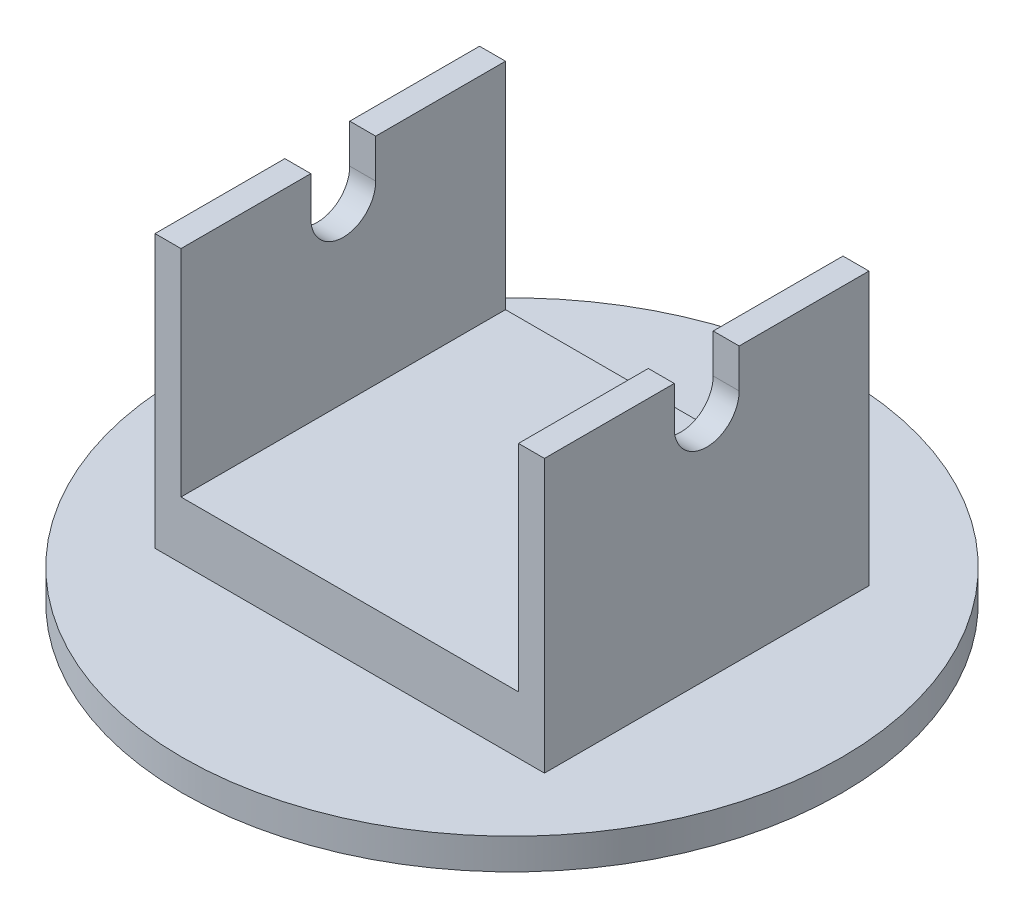
ISO-10303-21;
HEADER;
FILE_DESCRIPTION(('STEP AP214'),'2;1');
FILE_NAME('part.step','',(''),(''),'','','');
FILE_SCHEMA(('AUTOMOTIVE_DESIGN { 1 0 10303 214 1 1 1 1 }'));
ENDSEC;
DATA;
#1=APPLICATION_CONTEXT('core data for automotive mechanical design processes');
#2=APPLICATION_PROTOCOL_DEFINITION('international standard','automotive_design',2000,#1);
#3=PRODUCT_CONTEXT('',#1,'mechanical');
#4=PRODUCT('Part','Part','',(#3));
#5=PRODUCT_RELATED_PRODUCT_CATEGORY('part','',(#4));
#6=PRODUCT_DEFINITION_FORMATION('','',#4);
#7=PRODUCT_DEFINITION_CONTEXT('part definition',#1,'design');
#8=PRODUCT_DEFINITION('design','',#6,#7);
#9=PRODUCT_DEFINITION_SHAPE('','',#8);
#10=(LENGTH_UNIT() NAMED_UNIT(*) SI_UNIT(.MILLI.,.METRE.));
#11=(NAMED_UNIT(*) PLANE_ANGLE_UNIT() SI_UNIT($,.RADIAN.));
#12=(NAMED_UNIT(*) SI_UNIT($,.STERADIAN.) SOLID_ANGLE_UNIT());
#13=UNCERTAINTY_MEASURE_WITH_UNIT(LENGTH_MEASURE(1.E-05),#10,'distance_accuracy_value','');
#14=(GEOMETRIC_REPRESENTATION_CONTEXT(3) GLOBAL_UNCERTAINTY_ASSIGNED_CONTEXT((#13)) GLOBAL_UNIT_ASSIGNED_CONTEXT((#10,
#11,#12)) REPRESENTATION_CONTEXT('',''));
#15=CARTESIAN_POINT('',(0.,0.,0.));
#16=DIRECTION('',(0.,0.,1.));
#17=DIRECTION('',(1.,0.,0.));
#18=AXIS2_PLACEMENT_3D('',#15,#16,#17);
#19=CARTESIAN_POINT('',(30.,46.7625,-16.));
#20=DIRECTION('',(0.,-1.,0.));
#21=DIRECTION('',(0.,0.,-1.));
#22=AXIS2_PLACEMENT_3D('',#19,#20,#21);
#23=PLANE('',#22);
#24=DIRECTION('',(1.,0.,0.));
#25=VECTOR('',#24,1.);
#26=CARTESIAN_POINT('',(-50.8,46.7625,5.));
#27=LINE('',#26,#25);
#28=CARTESIAN_POINT('',(26.,46.7625,5.));
#29=VERTEX_POINT('',#28);
#30=CARTESIAN_POINT('',(30.,46.7625,5.));
#31=VERTEX_POINT('',#30);
#32=EDGE_CURVE('E278',#29,#31,#27,.T.);
#33=ORIENTED_EDGE('',*,*,#32,.F.);
#34=DIRECTION('',(0.,0.,1.));
#35=VECTOR('',#34,1.);
#36=CARTESIAN_POINT('',(26.,46.7625,-50.8));
#37=LINE('',#36,#35);
#38=CARTESIAN_POINT('',(26.,46.7625,25.));
#39=VERTEX_POINT('',#38);
#40=EDGE_CURVE('E291',#29,#39,#37,.T.);
#41=ORIENTED_EDGE('',*,*,#40,.T.);
#42=DIRECTION('',(-1.,0.,0.));
#43=VECTOR('',#42,1.);
#44=CARTESIAN_POINT('',(-30.,46.7625,25.));
#45=LINE('',#44,#43);
#46=CARTESIAN_POINT('',(30.,46.7625,25.));
#47=VERTEX_POINT('',#46);
#48=EDGE_CURVE('E169',#47,#39,#45,.T.);
#49=ORIENTED_EDGE('',*,*,#48,.F.);
#50=DIRECTION('',(0.,0.,1.));
#51=VECTOR('',#50,1.);
#52=CARTESIAN_POINT('',(30.,46.7625,-16.));
#53=LINE('',#52,#51);
#54=EDGE_CURVE('E178',#31,#47,#53,.T.);
#55=ORIENTED_EDGE('',*,*,#54,.F.);
#56=EDGE_LOOP('',(#33,#41,#49,#55));
#57=FACE_BOUND('',#56,.T.);
#58=ADVANCED_FACE('F33',(#57),#23,.F.);
#59=DIRECTION('',(1.,0.,0.));
#60=VECTOR('',#59,1.);
#61=CARTESIAN_POINT('',(-30.,46.7625,-25.));
#62=LINE('',#61,#60);
#63=CARTESIAN_POINT('',(26.,46.7625,-25.));
#64=VERTEX_POINT('',#63);
#65=CARTESIAN_POINT('',(30.,46.7625,-25.));
#66=VERTEX_POINT('',#65);
#67=EDGE_CURVE('E167',#64,#66,#62,.T.);
#68=ORIENTED_EDGE('',*,*,#67,.F.);
#69=CARTESIAN_POINT('',(26.,46.7625,-5.));
#70=VERTEX_POINT('',#69);
#71=EDGE_CURVE('E268',#64,#70,#37,.T.);
#72=ORIENTED_EDGE('',*,*,#71,.T.);
#73=DIRECTION('',(1.,0.,0.));
#74=VECTOR('',#73,1.);
#75=CARTESIAN_POINT('',(-50.8,46.7625,-5.));
#76=LINE('',#75,#74);
#77=CARTESIAN_POINT('',(30.,46.7625,-5.));
#78=VERTEX_POINT('',#77);
#79=EDGE_CURVE('E216',#70,#78,#76,.T.);
#80=ORIENTED_EDGE('',*,*,#79,.T.);
#81=EDGE_CURVE('E180',#66,#78,#53,.T.);
#82=ORIENTED_EDGE('',*,*,#81,.F.);
#83=EDGE_LOOP('',(#68,#72,#80,#82));
#84=FACE_BOUND('',#83,.T.);
#85=ADVANCED_FACE('F267',(#84),#23,.F.);
#86=CARTESIAN_POINT('',(-50.8,40.7625,0.));
#87=DIRECTION('',(1.,0.,0.));
#88=DIRECTION('',(0.,0.,-1.));
#89=AXIS2_PLACEMENT_3D('',#86,#87,#88);
#90=CYLINDRICAL_SURFACE('',#89,5.);
#91=DIRECTION('',(1.,0.,0.));
#92=VECTOR('',#91,1.);
#93=CARTESIAN_POINT('',(-50.8,40.7625,-5.));
#94=LINE('',#93,#92);
#95=CARTESIAN_POINT('',(26.,40.7625,-5.));
#96=VERTEX_POINT('',#95);
#97=CARTESIAN_POINT('',(30.,40.7625,-5.));
#98=VERTEX_POINT('',#97);
#99=EDGE_CURVE('E214',#96,#98,#94,.T.);
#100=ORIENTED_EDGE('',*,*,#99,.F.);
#101=CARTESIAN_POINT('',(26.,40.7625,0.));
#102=DIRECTION('',(1.,0.,0.));
#103=DIRECTION('',(0.,0.,-1.));
#104=AXIS2_PLACEMENT_3D('',#101,#102,#103);
#105=CIRCLE('',#104,5.);
#106=CARTESIAN_POINT('',(26.,40.7625,5.));
#107=VERTEX_POINT('',#106);
#108=EDGE_CURVE('E152',#96,#107,#105,.F.);
#109=ORIENTED_EDGE('',*,*,#108,.T.);
#110=DIRECTION('',(1.,0.,0.));
#111=VECTOR('',#110,1.);
#112=CARTESIAN_POINT('',(-50.8,40.7625,5.));
#113=LINE('',#112,#111);
#114=CARTESIAN_POINT('',(30.,40.7625,5.));
#115=VERTEX_POINT('',#114);
#116=EDGE_CURVE('E275',#107,#115,#113,.T.);
#117=ORIENTED_EDGE('',*,*,#116,.T.);
#118=CARTESIAN_POINT('',(30.,40.7625,0.));
#119=DIRECTION('',(1.,0.,0.));
#120=DIRECTION('',(0.,0.,-1.));
#121=AXIS2_PLACEMENT_3D('',#118,#119,#120);
#122=CIRCLE('',#121,5.);
#123=EDGE_CURVE('E224',#115,#98,#122,.T.);
#124=ORIENTED_EDGE('',*,*,#123,.T.);
#125=EDGE_LOOP('',(#100,#109,#117,#124));
#126=FACE_BOUND('',#125,.T.);
#127=ADVANCED_FACE('F221',(#126),#90,.F.);
#128=CARTESIAN_POINT('',(-50.8,40.7625,5.));
#129=DIRECTION('',(0.,0.,1.));
#130=DIRECTION('',(0.,-1.,0.));
#131=AXIS2_PLACEMENT_3D('',#128,#129,#130);
#132=PLANE('',#131);
#133=ORIENTED_EDGE('',*,*,#116,.F.);
#134=DIRECTION('',(0.,1.,0.));
#135=VECTOR('',#134,1.);
#136=CARTESIAN_POINT('',(26.,40.7625,5.));
#137=LINE('',#136,#135);
#138=EDGE_CURVE('E286',#107,#29,#137,.T.);
#139=ORIENTED_EDGE('',*,*,#138,.T.);
#140=ORIENTED_EDGE('',*,*,#32,.T.);
#141=DIRECTION('',(0.,-1.,0.));
#142=VECTOR('',#141,1.);
#143=CARTESIAN_POINT('',(30.,40.7625,5.));
#144=LINE('',#143,#142);
#145=EDGE_CURVE('E227',#31,#115,#144,.T.);
#146=ORIENTED_EDGE('',*,*,#145,.T.);
#147=EDGE_LOOP('',(#133,#139,#140,#146));
#148=FACE_BOUND('',#147,.T.);
#149=ADVANCED_FACE('F285',(#148),#132,.F.);
#150=CARTESIAN_POINT('',(-50.8,40.7625,-5.));
#151=DIRECTION('',(0.,0.,-1.));
#152=DIRECTION('',(0.,1.,0.));
#153=AXIS2_PLACEMENT_3D('',#150,#151,#152);
#154=PLANE('',#153);
#155=ORIENTED_EDGE('',*,*,#79,.F.);
#156=DIRECTION('',(0.,-1.,0.));
#157=VECTOR('',#156,1.);
#158=CARTESIAN_POINT('',(26.,40.7625,-5.));
#159=LINE('',#158,#157);
#160=EDGE_CURVE('E41',#70,#96,#159,.T.);
#161=ORIENTED_EDGE('',*,*,#160,.T.);
#162=ORIENTED_EDGE('',*,*,#99,.T.);
#163=DIRECTION('',(0.,1.,0.));
#164=VECTOR('',#163,1.);
#165=CARTESIAN_POINT('',(30.,40.7625,-5.));
#166=LINE('',#165,#164);
#167=EDGE_CURVE('E231',#98,#78,#166,.T.);
#168=ORIENTED_EDGE('',*,*,#167,.T.);
#169=EDGE_LOOP('',(#155,#161,#162,#168));
#170=FACE_BOUND('',#169,.T.);
#171=ADVANCED_FACE('F212',(#170),#154,.F.);
#172=CARTESIAN_POINT('',(-26.,46.7625,25.));
#173=VERTEX_POINT('',#172);
#174=CARTESIAN_POINT('',(-30.,46.7625,25.));
#175=VERTEX_POINT('',#174);
#176=EDGE_CURVE('E166',#173,#175,#45,.T.);
#177=ORIENTED_EDGE('',*,*,#176,.F.);
#178=DIRECTION('',(0.,0.,1.));
#179=VECTOR('',#178,1.);
#180=CARTESIAN_POINT('',(-26.,46.7625,-50.8));
#181=LINE('',#180,#179);
#182=CARTESIAN_POINT('',(-26.,46.7625,5.));
#183=VERTEX_POINT('',#182);
#184=EDGE_CURVE('E161',#183,#173,#181,.T.);
#185=ORIENTED_EDGE('',*,*,#184,.F.);
#186=CARTESIAN_POINT('',(-30.,46.7625,5.));
#187=VERTEX_POINT('',#186);
#188=EDGE_CURVE('E276',#187,#183,#27,.T.);
#189=ORIENTED_EDGE('',*,*,#188,.F.);
#190=DIRECTION('',(0.,0.,1.));
#191=VECTOR('',#190,1.);
#192=CARTESIAN_POINT('',(-30.,46.7625,-16.));
#193=LINE('',#192,#191);
#194=EDGE_CURVE('E187',#187,#175,#193,.T.);
#195=ORIENTED_EDGE('',*,*,#194,.T.);
#196=EDGE_LOOP('',(#177,#185,#189,#195));
#197=FACE_BOUND('',#196,.T.);
#198=ADVANCED_FACE('F314',(#197),#23,.F.);
#199=CARTESIAN_POINT('',(0.,4.7625,0.));
#200=DIRECTION('',(0.,-1.,0.));
#201=DIRECTION('',(0.,0.,-1.));
#202=AXIS2_PLACEMENT_3D('',#199,#200,#201);
#203=CYLINDRICAL_SURFACE('',#202,50.8);
#204=CARTESIAN_POINT('',(0.,4.7625,0.));
#205=DIRECTION('',(0.,1.,0.));
#206=DIRECTION('',(0.,0.,1.));
#207=AXIS2_PLACEMENT_3D('',#204,#205,#206);
#208=CIRCLE('',#207,50.8);
#209=CARTESIAN_POINT('',(0.,4.7625,50.8));
#210=VERTEX_POINT('',#209);
#211=EDGE_CURVE('E194',#210,#210,#208,.T.);
#212=ORIENTED_EDGE('',*,*,#211,.F.);
#213=EDGE_LOOP('',(#212));
#214=FACE_BOUND('',#213,.T.);
#215=CARTESIAN_POINT('',(0.,0.,0.));
#216=DIRECTION('',(0.,1.,0.));
#217=DIRECTION('',(0.,0.,1.));
#218=AXIS2_PLACEMENT_3D('',#215,#216,#217);
#219=CIRCLE('',#218,50.8);
#220=CARTESIAN_POINT('',(0.,0.,50.8));
#221=VERTEX_POINT('',#220);
#222=EDGE_CURVE('E193',#221,#221,#219,.T.);
#223=ORIENTED_EDGE('',*,*,#222,.T.);
#224=EDGE_LOOP('',(#223));
#225=FACE_BOUND('',#224,.T.);
#226=ADVANCED_FACE('F35',(#214,#225),#203,.T.);
#227=CARTESIAN_POINT('',(0.,4.7625,0.));
#228=DIRECTION('',(0.,1.,0.));
#229=DIRECTION('',(0.,0.,1.));
#230=AXIS2_PLACEMENT_3D('',#227,#228,#229);
#231=PLANE('',#230);
#232=DIRECTION('',(0.,0.,-1.));
#233=VECTOR('',#232,1.);
#234=CARTESIAN_POINT('',(30.,4.7625,25.));
#235=LINE('',#234,#233);
#236=CARTESIAN_POINT('',(30.,4.7625,25.));
#237=VERTEX_POINT('',#236);
#238=CARTESIAN_POINT('',(30.,4.76250000000003,-25.));
#239=VERTEX_POINT('',#238);
#240=EDGE_CURVE('E175',#237,#239,#235,.T.);
#241=ORIENTED_EDGE('',*,*,#240,.F.);
#242=DIRECTION('',(-1.,0.,0.));
#243=VECTOR('',#242,1.);
#244=CARTESIAN_POINT('',(30.,4.7625,25.));
#245=LINE('',#244,#243);
#246=CARTESIAN_POINT('',(-30.,4.7625,25.));
#247=VERTEX_POINT('',#246);
#248=EDGE_CURVE('E190',#237,#247,#245,.T.);
#249=ORIENTED_EDGE('',*,*,#248,.T.);
#250=DIRECTION('',(0.,0.,-1.));
#251=VECTOR('',#250,1.);
#252=CARTESIAN_POINT('',(-30.,4.7625,25.));
#253=LINE('',#252,#251);
#254=CARTESIAN_POINT('',(-30.,4.76250000000003,-25.));
#255=VERTEX_POINT('',#254);
#256=EDGE_CURVE('E184',#247,#255,#253,.T.);
#257=ORIENTED_EDGE('',*,*,#256,.T.);
#258=DIRECTION('',(-1.,0.,0.));
#259=VECTOR('',#258,1.);
#260=CARTESIAN_POINT('',(30.,4.7625,-25.));
#261=LINE('',#260,#259);
#262=EDGE_CURVE('E183',#239,#255,#261,.T.);
#263=ORIENTED_EDGE('',*,*,#262,.F.);
#264=EDGE_LOOP('',(#241,#249,#257,#263));
#265=FACE_BOUND('',#264,.T.);
#266=ORIENTED_EDGE('',*,*,#211,.T.);
#267=EDGE_LOOP('',(#266));
#268=FACE_BOUND('',#267,.T.);
#269=ADVANCED_FACE('F257',(#265,#268),#231,.T.);
#270=CARTESIAN_POINT('',(0.,0.,0.));
#271=DIRECTION('',(0.,1.,0.));
#272=DIRECTION('',(0.,0.,1.));
#273=AXIS2_PLACEMENT_3D('',#270,#271,#272);
#274=PLANE('',#273);
#275=ORIENTED_EDGE('',*,*,#222,.F.);
#276=EDGE_LOOP('',(#275));
#277=FACE_BOUND('',#276,.T.);
#278=ADVANCED_FACE('F340',(#277),#274,.F.);
#279=CARTESIAN_POINT('',(-30.,46.7625,-5.));
#280=VERTEX_POINT('',#279);
#281=CARTESIAN_POINT('',(-26.,46.7625,-5.));
#282=VERTEX_POINT('',#281);
#283=EDGE_CURVE('E55',#280,#282,#76,.T.);
#284=ORIENTED_EDGE('',*,*,#283,.T.);
#285=CARTESIAN_POINT('',(-26.,46.7625,-25.));
#286=VERTEX_POINT('',#285);
#287=EDGE_CURVE('E48',#286,#282,#181,.T.);
#288=ORIENTED_EDGE('',*,*,#287,.F.);
#289=CARTESIAN_POINT('',(-30.,46.7625,-25.));
#290=VERTEX_POINT('',#289);
#291=EDGE_CURVE('E159',#290,#286,#62,.T.);
#292=ORIENTED_EDGE('',*,*,#291,.F.);
#293=EDGE_CURVE('E179',#290,#280,#193,.T.);
#294=ORIENTED_EDGE('',*,*,#293,.T.);
#295=EDGE_LOOP('',(#284,#288,#292,#294));
#296=FACE_BOUND('',#295,.T.);
#297=ADVANCED_FACE('F157',(#296),#23,.F.);
#298=CARTESIAN_POINT('',(30.,4.7625,25.));
#299=DIRECTION('',(1.,0.,0.));
#300=DIRECTION('',(0.,0.,-1.));
#301=AXIS2_PLACEMENT_3D('',#298,#299,#300);
#302=PLANE('',#301);
#303=ORIENTED_EDGE('',*,*,#145,.F.);
#304=ORIENTED_EDGE('',*,*,#54,.T.);
#305=DIRECTION('',(0.,-1.,0.));
#306=VECTOR('',#305,1.);
#307=CARTESIAN_POINT('',(30.,124.864996759067,25.));
#308=LINE('',#307,#306);
#309=EDGE_CURVE('E240',#47,#237,#308,.T.);
#310=ORIENTED_EDGE('',*,*,#309,.T.);
#311=ORIENTED_EDGE('',*,*,#240,.T.);
#312=DIRECTION('',(0.,-1.,0.));
#313=VECTOR('',#312,1.);
#314=CARTESIAN_POINT('',(30.,124.864996759067,-25.));
#315=LINE('',#314,#313);
#316=EDGE_CURVE('E238',#66,#239,#315,.T.);
#317=ORIENTED_EDGE('',*,*,#316,.F.);
#318=ORIENTED_EDGE('',*,*,#81,.T.);
#319=ORIENTED_EDGE('',*,*,#167,.F.);
#320=ORIENTED_EDGE('',*,*,#123,.F.);
#321=EDGE_LOOP('',(#303,#304,#310,#311,#317,#318,#319,#320));
#322=FACE_BOUND('',#321,.T.);
#323=ADVANCED_FACE('F261',(#322),#302,.T.);
#324=CARTESIAN_POINT('',(-30.,4.7625,25.));
#325=DIRECTION('',(1.,0.,0.));
#326=DIRECTION('',(0.,0.,-1.));
#327=AXIS2_PLACEMENT_3D('',#324,#325,#326);
#328=PLANE('',#327);
#329=ORIENTED_EDGE('',*,*,#194,.F.);
#330=DIRECTION('',(0.,-1.,0.));
#331=VECTOR('',#330,1.);
#332=CARTESIAN_POINT('',(-30.,4.76250000000001,5.));
#333=LINE('',#332,#331);
#334=CARTESIAN_POINT('',(-30.,40.7625,5.));
#335=VERTEX_POINT('',#334);
#336=EDGE_CURVE('E204',#187,#335,#333,.T.);
#337=ORIENTED_EDGE('',*,*,#336,.T.);
#338=CARTESIAN_POINT('',(-30.,40.7625,0.));
#339=DIRECTION('',(1.,0.,0.));
#340=DIRECTION('',(0.,0.,-1.));
#341=AXIS2_PLACEMENT_3D('',#338,#339,#340);
#342=CIRCLE('',#341,5.);
#343=CARTESIAN_POINT('',(-30.,40.7625,-5.));
#344=VERTEX_POINT('',#343);
#345=EDGE_CURVE('E201',#335,#344,#342,.T.);
#346=ORIENTED_EDGE('',*,*,#345,.T.);
#347=DIRECTION('',(0.,1.,0.));
#348=VECTOR('',#347,1.);
#349=CARTESIAN_POINT('',(-30.,4.7625,-5.));
#350=LINE('',#349,#348);
#351=EDGE_CURVE('E197',#344,#280,#350,.T.);
#352=ORIENTED_EDGE('',*,*,#351,.T.);
#353=ORIENTED_EDGE('',*,*,#293,.F.);
#354=DIRECTION('',(0.,-1.,0.));
#355=VECTOR('',#354,1.);
#356=CARTESIAN_POINT('',(-30.,124.864996759067,-25.));
#357=LINE('',#356,#355);
#358=EDGE_CURVE('E165',#290,#255,#357,.T.);
#359=ORIENTED_EDGE('',*,*,#358,.T.);
#360=ORIENTED_EDGE('',*,*,#256,.F.);
#361=DIRECTION('',(0.,-1.,0.));
#362=VECTOR('',#361,1.);
#363=CARTESIAN_POINT('',(-30.,124.864996759067,25.));
#364=LINE('',#363,#362);
#365=EDGE_CURVE('E171',#175,#247,#364,.T.);
#366=ORIENTED_EDGE('',*,*,#365,.F.);
#367=EDGE_LOOP('',(#329,#337,#346,#352,#353,#359,#360,#366));
#368=FACE_BOUND('',#367,.T.);
#369=ADVANCED_FACE('F254',(#368),#328,.F.);
#370=CARTESIAN_POINT('',(-30.,124.864996759067,-25.));
#371=DIRECTION('',(0.,0.,1.));
#372=DIRECTION('',(1.,0.,0.));
#373=AXIS2_PLACEMENT_3D('',#370,#371,#372);
#374=PLANE('',#373);
#375=DIRECTION('',(1.,0.,0.));
#376=VECTOR('',#375,1.);
#377=CARTESIAN_POINT('',(-30.,13.6088,-25.));
#378=LINE('',#377,#376);
#379=CARTESIAN_POINT('',(-26.,13.6088,-25.));
#380=VERTEX_POINT('',#379);
#381=CARTESIAN_POINT('',(26.,13.6088,-25.));
#382=VERTEX_POINT('',#381);
#383=EDGE_CURVE('E270',#380,#382,#378,.T.);
#384=ORIENTED_EDGE('',*,*,#383,.T.);
#385=DIRECTION('',(0.,1.,0.));
#386=VECTOR('',#385,1.);
#387=CARTESIAN_POINT('',(26.,124.864996759067,-25.));
#388=LINE('',#387,#386);
#389=EDGE_CURVE('E265',#382,#64,#388,.T.);
#390=ORIENTED_EDGE('',*,*,#389,.T.);
#391=ORIENTED_EDGE('',*,*,#67,.T.);
#392=ORIENTED_EDGE('',*,*,#316,.T.);
#393=ORIENTED_EDGE('',*,*,#262,.T.);
#394=ORIENTED_EDGE('',*,*,#358,.F.);
#395=ORIENTED_EDGE('',*,*,#291,.T.);
#396=DIRECTION('',(0.,-1.,0.));
#397=VECTOR('',#396,1.);
#398=CARTESIAN_POINT('',(-26.,124.864996759067,-25.));
#399=LINE('',#398,#397);
#400=EDGE_CURVE('E145',#286,#380,#399,.T.);
#401=ORIENTED_EDGE('',*,*,#400,.T.);
#402=EDGE_LOOP('',(#384,#390,#391,#392,#393,#394,#395,#401));
#403=FACE_BOUND('',#402,.T.);
#404=ADVANCED_FACE('F163',(#403),#374,.F.);
#405=CARTESIAN_POINT('',(-30.,124.864996759067,25.));
#406=DIRECTION('',(0.,0.,-1.));
#407=DIRECTION('',(-1.,0.,0.));
#408=AXIS2_PLACEMENT_3D('',#405,#406,#407);
#409=PLANE('',#408);
#410=ORIENTED_EDGE('',*,*,#48,.T.);
#411=DIRECTION('',(0.,-1.,0.));
#412=VECTOR('',#411,1.);
#413=CARTESIAN_POINT('',(26.,124.864996759067,25.));
#414=LINE('',#413,#412);
#415=CARTESIAN_POINT('',(26.,13.6088,25.));
#416=VERTEX_POINT('',#415);
#417=EDGE_CURVE('E293',#39,#416,#414,.T.);
#418=ORIENTED_EDGE('',*,*,#417,.T.);
#419=DIRECTION('',(-1.,0.,0.));
#420=VECTOR('',#419,1.);
#421=CARTESIAN_POINT('',(-30.,13.6088,25.));
#422=LINE('',#421,#420);
#423=CARTESIAN_POINT('',(-26.,13.6088,25.));
#424=VERTEX_POINT('',#423);
#425=EDGE_CURVE('E11',#416,#424,#422,.T.);
#426=ORIENTED_EDGE('',*,*,#425,.T.);
#427=DIRECTION('',(0.,1.,0.));
#428=VECTOR('',#427,1.);
#429=CARTESIAN_POINT('',(-26.,124.864996759067,25.));
#430=LINE('',#429,#428);
#431=EDGE_CURVE('E153',#424,#173,#430,.T.);
#432=ORIENTED_EDGE('',*,*,#431,.T.);
#433=ORIENTED_EDGE('',*,*,#176,.T.);
#434=ORIENTED_EDGE('',*,*,#365,.T.);
#435=ORIENTED_EDGE('',*,*,#248,.F.);
#436=ORIENTED_EDGE('',*,*,#309,.F.);
#437=EDGE_LOOP('',(#410,#418,#426,#432,#433,#434,#435,#436));
#438=FACE_BOUND('',#437,.T.);
#439=ADVANCED_FACE('F248',(#438),#409,.F.);
#440=CARTESIAN_POINT('',(-26.,40.7625,5.));
#441=VERTEX_POINT('',#440);
#442=EDGE_CURVE('E239',#335,#441,#113,.T.);
#443=ORIENTED_EDGE('',*,*,#442,.T.);
#444=CARTESIAN_POINT('',(-26.,40.7625,0.));
#445=DIRECTION('',(-1.,0.,0.));
#446=DIRECTION('',(0.,0.,1.));
#447=AXIS2_PLACEMENT_3D('',#444,#445,#446);
#448=CIRCLE('',#447,5.);
#449=CARTESIAN_POINT('',(-26.,40.7625,-5.));
#450=VERTEX_POINT('',#449);
#451=EDGE_CURVE('E303',#441,#450,#448,.F.);
#452=ORIENTED_EDGE('',*,*,#451,.T.);
#453=EDGE_CURVE('E226',#344,#450,#94,.T.);
#454=ORIENTED_EDGE('',*,*,#453,.F.);
#455=ORIENTED_EDGE('',*,*,#345,.F.);
#456=EDGE_LOOP('',(#443,#452,#454,#455));
#457=FACE_BOUND('',#456,.T.);
#458=ADVANCED_FACE('F318',(#457),#90,.F.);
#459=ORIENTED_EDGE('',*,*,#188,.T.);
#460=DIRECTION('',(0.,-1.,0.));
#461=VECTOR('',#460,1.);
#462=CARTESIAN_POINT('',(-26.,40.7625,5.));
#463=LINE('',#462,#461);
#464=EDGE_CURVE('E306',#183,#441,#463,.T.);
#465=ORIENTED_EDGE('',*,*,#464,.T.);
#466=ORIENTED_EDGE('',*,*,#442,.F.);
#467=ORIENTED_EDGE('',*,*,#336,.F.);
#468=EDGE_LOOP('',(#459,#465,#466,#467));
#469=FACE_BOUND('',#468,.T.);
#470=ADVANCED_FACE('F316',(#469),#132,.F.);
#471=ORIENTED_EDGE('',*,*,#453,.T.);
#472=DIRECTION('',(0.,1.,0.));
#473=VECTOR('',#472,1.);
#474=CARTESIAN_POINT('',(-26.,40.7625,-5.));
#475=LINE('',#474,#473);
#476=EDGE_CURVE('E207',#450,#282,#475,.T.);
#477=ORIENTED_EDGE('',*,*,#476,.T.);
#478=ORIENTED_EDGE('',*,*,#283,.F.);
#479=ORIENTED_EDGE('',*,*,#351,.F.);
#480=EDGE_LOOP('',(#471,#477,#478,#479));
#481=FACE_BOUND('',#480,.T.);
#482=ADVANCED_FACE('F320',(#481),#154,.F.);
#483=CARTESIAN_POINT('',(-26.,13.6088,-50.8));
#484=DIRECTION('',(0.,-1.,0.));
#485=DIRECTION('',(0.,0.,-1.));
#486=AXIS2_PLACEMENT_3D('',#483,#484,#485);
#487=PLANE('',#486);
#488=DIRECTION('',(0.,0.,1.));
#489=VECTOR('',#488,1.);
#490=CARTESIAN_POINT('',(-26.,13.6088,-50.8));
#491=LINE('',#490,#489);
#492=EDGE_CURVE('E148',#380,#424,#491,.T.);
#493=ORIENTED_EDGE('',*,*,#492,.T.);
#494=ORIENTED_EDGE('',*,*,#425,.F.);
#495=DIRECTION('',(0.,0.,1.));
#496=VECTOR('',#495,1.);
#497=CARTESIAN_POINT('',(26.,13.6088,-50.8));
#498=LINE('',#497,#496);
#499=EDGE_CURVE('E302',#382,#416,#498,.T.);
#500=ORIENTED_EDGE('',*,*,#499,.F.);
#501=ORIENTED_EDGE('',*,*,#383,.F.);
#502=EDGE_LOOP('',(#493,#494,#500,#501));
#503=FACE_BOUND('',#502,.T.);
#504=ADVANCED_FACE('F301',(#503),#487,.F.);
#505=CARTESIAN_POINT('',(26.,13.6088,-50.8));
#506=DIRECTION('',(1.,0.,0.));
#507=DIRECTION('',(0.,0.,-1.));
#508=AXIS2_PLACEMENT_3D('',#505,#506,#507);
#509=PLANE('',#508);
#510=ORIENTED_EDGE('',*,*,#499,.T.);
#511=ORIENTED_EDGE('',*,*,#417,.F.);
#512=ORIENTED_EDGE('',*,*,#40,.F.);
#513=ORIENTED_EDGE('',*,*,#138,.F.);
#514=ORIENTED_EDGE('',*,*,#108,.F.);
#515=ORIENTED_EDGE('',*,*,#160,.F.);
#516=ORIENTED_EDGE('',*,*,#71,.F.);
#517=ORIENTED_EDGE('',*,*,#389,.F.);
#518=EDGE_LOOP('',(#510,#511,#512,#513,#514,#515,#516,#517));
#519=FACE_BOUND('',#518,.T.);
#520=ADVANCED_FACE('F327',(#519),#509,.F.);
#521=CARTESIAN_POINT('',(-26.,13.6088,-50.8));
#522=DIRECTION('',(-1.,0.,0.));
#523=DIRECTION('',(0.,0.,1.));
#524=AXIS2_PLACEMENT_3D('',#521,#522,#523);
#525=PLANE('',#524);
#526=ORIENTED_EDGE('',*,*,#287,.T.);
#527=ORIENTED_EDGE('',*,*,#476,.F.);
#528=ORIENTED_EDGE('',*,*,#451,.F.);
#529=ORIENTED_EDGE('',*,*,#464,.F.);
#530=ORIENTED_EDGE('',*,*,#184,.T.);
#531=ORIENTED_EDGE('',*,*,#431,.F.);
#532=ORIENTED_EDGE('',*,*,#492,.F.);
#533=ORIENTED_EDGE('',*,*,#400,.F.);
#534=EDGE_LOOP('',(#526,#527,#528,#529,#530,#531,#532,#533));
#535=FACE_BOUND('',#534,.T.);
#536=ADVANCED_FACE('F146',(#535),#525,.F.);
#537=CLOSED_SHELL('',(#58,#85,#127,#149,#171,#198,#226,#269,#278,#297,#323,#369,#404,#439,#458,
#470,#482,#504,#520,#536));
#538=MANIFOLD_SOLID_BREP('B2',#537);
#539=ADVANCED_BREP_SHAPE_REPRESENTATION('',(#18,#538),#14);
#540=SHAPE_DEFINITION_REPRESENTATION(#9,#539);
ENDSEC;
END-ISO-10303-21;
